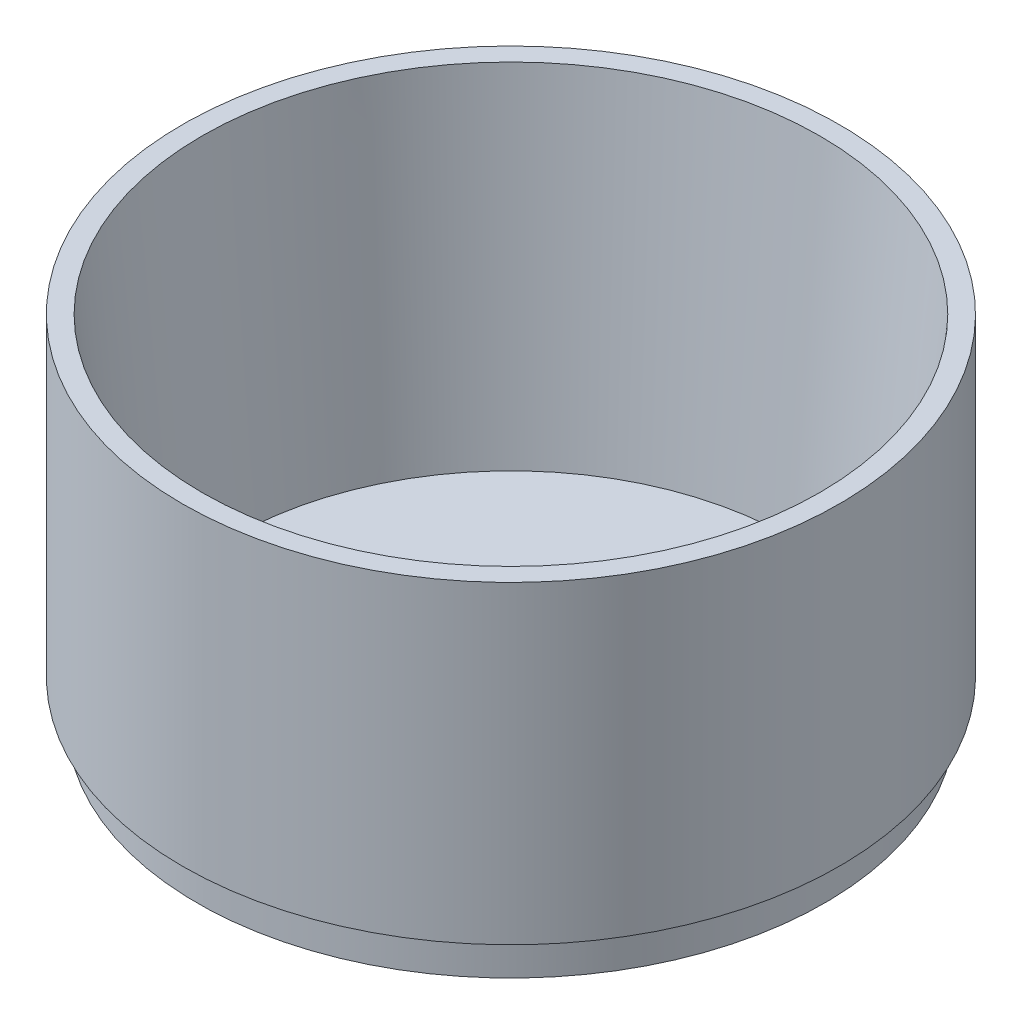
ISO-10303-21;
HEADER;
FILE_DESCRIPTION(('STEP AP214'),'2;1');
FILE_NAME('part.step','',(''),(''),'','','');
FILE_SCHEMA(('AUTOMOTIVE_DESIGN { 1 0 10303 214 1 1 1 1 }'));
ENDSEC;
DATA;
#1=APPLICATION_CONTEXT('core data for automotive mechanical design processes');
#2=APPLICATION_PROTOCOL_DEFINITION('international standard','automotive_design',2000,#1);
#3=PRODUCT_CONTEXT('',#1,'mechanical');
#4=PRODUCT('Part','Part','',(#3));
#5=PRODUCT_RELATED_PRODUCT_CATEGORY('part','',(#4));
#6=PRODUCT_DEFINITION_FORMATION('','',#4);
#7=PRODUCT_DEFINITION_CONTEXT('part definition',#1,'design');
#8=PRODUCT_DEFINITION('design','',#6,#7);
#9=PRODUCT_DEFINITION_SHAPE('','',#8);
#10=(LENGTH_UNIT() NAMED_UNIT(*) SI_UNIT(.MILLI.,.METRE.));
#11=(NAMED_UNIT(*) PLANE_ANGLE_UNIT() SI_UNIT($,.RADIAN.));
#12=(NAMED_UNIT(*) SI_UNIT($,.STERADIAN.) SOLID_ANGLE_UNIT());
#13=UNCERTAINTY_MEASURE_WITH_UNIT(LENGTH_MEASURE(1.E-05),#10,'distance_accuracy_value','');
#14=(GEOMETRIC_REPRESENTATION_CONTEXT(3) GLOBAL_UNCERTAINTY_ASSIGNED_CONTEXT((#13)) GLOBAL_UNIT_ASSIGNED_CONTEXT((#10,
#11,#12)) REPRESENTATION_CONTEXT('',''));
#15=CARTESIAN_POINT('',(0.,0.,0.));
#16=DIRECTION('',(0.,0.,1.));
#17=DIRECTION('',(1.,0.,0.));
#18=AXIS2_PLACEMENT_3D('',#15,#16,#17);
#19=CARTESIAN_POINT('',(0.,50.8,0.));
#20=DIRECTION('',(0.,-1.,0.));
#21=DIRECTION('',(0.,0.,-1.));
#22=AXIS2_PLACEMENT_3D('',#19,#20,#21);
#23=CYLINDRICAL_SURFACE('',#22,53.18125);
#24=CARTESIAN_POINT('',(0.,50.8,0.));
#25=DIRECTION('',(0.,1.,0.));
#26=DIRECTION('',(0.,0.,1.));
#27=AXIS2_PLACEMENT_3D('',#24,#25,#26);
#28=CIRCLE('',#27,53.18125);
#29=CARTESIAN_POINT('',(0.,50.8,53.18125));
#30=VERTEX_POINT('',#29);
#31=EDGE_CURVE('E51',#30,#30,#28,.T.);
#32=ORIENTED_EDGE('',*,*,#31,.F.);
#33=EDGE_LOOP('',(#32));
#34=FACE_BOUND('',#33,.T.);
#35=CARTESIAN_POINT('',(0.,0.,0.));
#36=DIRECTION('',(0.,1.,0.));
#37=DIRECTION('',(0.,0.,1.));
#38=AXIS2_PLACEMENT_3D('',#35,#36,#37);
#39=CIRCLE('',#38,53.18125);
#40=CARTESIAN_POINT('',(0.,0.,53.18125));
#41=VERTEX_POINT('',#40);
#42=EDGE_CURVE('E46',#41,#41,#39,.T.);
#43=ORIENTED_EDGE('',*,*,#42,.T.);
#44=EDGE_LOOP('',(#43));
#45=FACE_BOUND('',#44,.T.);
#46=ADVANCED_FACE('F43',(#34,#45),#23,.T.);
#47=CARTESIAN_POINT('',(0.,50.8,0.));
#48=DIRECTION('',(0.,1.,0.));
#49=DIRECTION('',(0.,0.,1.));
#50=AXIS2_PLACEMENT_3D('',#47,#48,#49);
#51=PLANE('',#50);
#52=CARTESIAN_POINT('',(0.,50.8,0.));
#53=DIRECTION('',(0.,1.,0.));
#54=DIRECTION('',(0.,0.,1.));
#55=AXIS2_PLACEMENT_3D('',#52,#53,#54);
#56=CIRCLE('',#55,50.00625);
#57=CARTESIAN_POINT('',(0.,50.8,50.00625));
#58=VERTEX_POINT('',#57);
#59=EDGE_CURVE('E66',#58,#58,#56,.T.);
#60=ORIENTED_EDGE('',*,*,#59,.F.);
#61=EDGE_LOOP('',(#60));
#62=FACE_BOUND('',#61,.T.);
#63=ORIENTED_EDGE('',*,*,#31,.T.);
#64=EDGE_LOOP('',(#63));
#65=FACE_BOUND('',#64,.T.);
#66=ADVANCED_FACE('F121',(#62,#65),#51,.T.);
#67=CARTESIAN_POINT('',(0.,0.,0.));
#68=DIRECTION('',(0.,1.,0.));
#69=DIRECTION('',(0.,0.,1.));
#70=AXIS2_PLACEMENT_3D('',#67,#68,#69);
#71=PLANE('',#70);
#72=CARTESIAN_POINT('',(0.,0.,0.));
#73=DIRECTION('',(0.,-1.,0.));
#74=DIRECTION('',(0.,0.,-1.));
#75=AXIS2_PLACEMENT_3D('',#72,#73,#74);
#76=CIRCLE('',#75,50.8);
#77=CARTESIAN_POINT('',(0.,0.,-50.8));
#78=VERTEX_POINT('',#77);
#79=EDGE_CURVE('E11',#78,#78,#76,.T.);
#80=ORIENTED_EDGE('',*,*,#79,.F.);
#81=EDGE_LOOP('',(#80));
#82=FACE_BOUND('',#81,.T.);
#83=ORIENTED_EDGE('',*,*,#42,.F.);
#84=EDGE_LOOP('',(#83));
#85=FACE_BOUND('',#84,.T.);
#86=ADVANCED_FACE('F126',(#82,#85),#71,.F.);
#87=CARTESIAN_POINT('',(0.,-6.35,0.));
#88=DIRECTION('',(0.,1.,0.));
#89=DIRECTION('',(0.,0.,1.));
#90=AXIS2_PLACEMENT_3D('',#87,#88,#89);
#91=CYLINDRICAL_SURFACE('',#90,50.8);
#92=CARTESIAN_POINT('',(0.,-6.35,0.));
#93=DIRECTION('',(0.,-1.,0.));
#94=DIRECTION('',(0.,0.,-1.));
#95=AXIS2_PLACEMENT_3D('',#92,#93,#94);
#96=CIRCLE('',#95,50.8);
#97=CARTESIAN_POINT('',(0.,-6.35,-50.8));
#98=VERTEX_POINT('',#97);
#99=EDGE_CURVE('E58',#98,#98,#96,.T.);
#100=ORIENTED_EDGE('',*,*,#99,.F.);
#101=EDGE_LOOP('',(#100));
#102=FACE_BOUND('',#101,.T.);
#103=ORIENTED_EDGE('',*,*,#79,.T.);
#104=EDGE_LOOP('',(#103));
#105=FACE_BOUND('',#104,.T.);
#106=ADVANCED_FACE('F136',(#102,#105),#91,.T.);
#107=CARTESIAN_POINT('',(0.,-6.35,0.));
#108=DIRECTION('',(0.,-1.,0.));
#109=DIRECTION('',(0.,0.,-1.));
#110=AXIS2_PLACEMENT_3D('',#107,#108,#109);
#111=PLANE('',#110);
#112=CARTESIAN_POINT('',(7.48713179512813,-6.35,15.7759869337034));
#113=DIRECTION('',(0.,-1.,0.));
#114=DIRECTION('',(0.,0.,-1.));
#115=AXIS2_PLACEMENT_3D('',#112,#113,#114);
#116=CIRCLE('',#115,4.7625);
#117=CARTESIAN_POINT('',(7.48713179512813,-6.35,11.0134869337034));
#118=VERTEX_POINT('',#117);
#119=EDGE_CURVE('E70',#118,#118,#116,.F.);
#120=ORIENTED_EDGE('',*,*,#119,.T.);
#121=EDGE_LOOP('',(#120));
#122=FACE_BOUND('',#121,.T.);
#123=CARTESIAN_POINT('',(1.2743573258838E-13,-6.35,0.));
#124=DIRECTION('',(0.,-1.,0.));
#125=DIRECTION('',(0.,0.,-1.));
#126=AXIS2_PLACEMENT_3D('',#123,#124,#125);
#127=CIRCLE('',#126,4.7625);
#128=CARTESIAN_POINT('',(1.2743573258838E-13,-6.35,-4.76250000000004));
#129=VERTEX_POINT('',#128);
#130=EDGE_CURVE('E80',#129,#129,#127,.F.);
#131=ORIENTED_EDGE('',*,*,#130,.T.);
#132=EDGE_LOOP('',(#131));
#133=FACE_BOUND('',#132,.T.);
#134=CARTESIAN_POINT('',(-7.48713179512813,-6.35,-15.7759869337034));
#135=DIRECTION('',(0.,-1.,0.));
#136=DIRECTION('',(0.,0.,-1.));
#137=AXIS2_PLACEMENT_3D('',#134,#135,#136);
#138=CIRCLE('',#137,4.7625);
#139=CARTESIAN_POINT('',(-7.48713179512813,-6.35,-20.5384869337034));
#140=VERTEX_POINT('',#139);
#141=EDGE_CURVE('E71',#140,#140,#138,.F.);
#142=ORIENTED_EDGE('',*,*,#141,.T.);
#143=EDGE_LOOP('',(#142));
#144=FACE_BOUND('',#143,.T.);
#145=ORIENTED_EDGE('',*,*,#99,.T.);
#146=EDGE_LOOP('',(#145));
#147=FACE_BOUND('',#146,.T.);
#148=ADVANCED_FACE('F102',(#122,#133,#144,#147),#111,.T.);
#149=CARTESIAN_POINT('',(0.,-3.175,0.));
#150=DIRECTION('',(0.,-1.,0.));
#151=DIRECTION('',(0.,0.,-1.));
#152=AXIS2_PLACEMENT_3D('',#149,#150,#151);
#153=PLANE('',#152);
#154=CARTESIAN_POINT('',(7.48713179512813,-3.175,15.7759869337034));
#155=DIRECTION('',(0.,1.,0.));
#156=DIRECTION('',(0.,0.,1.));
#157=AXIS2_PLACEMENT_3D('',#154,#155,#156);
#158=CIRCLE('',#157,4.7625);
#159=CARTESIAN_POINT('',(7.48713179512813,-3.175,20.5384869337034));
#160=VERTEX_POINT('',#159);
#161=EDGE_CURVE('E84',#160,#160,#158,.T.);
#162=ORIENTED_EDGE('',*,*,#161,.F.);
#163=EDGE_LOOP('',(#162));
#164=FACE_BOUND('',#163,.T.);
#165=CARTESIAN_POINT('',(1.2743573258838E-13,-3.175,0.));
#166=DIRECTION('',(0.,1.,0.));
#167=DIRECTION('',(0.,0.,1.));
#168=AXIS2_PLACEMENT_3D('',#165,#166,#167);
#169=CIRCLE('',#168,4.7625);
#170=CARTESIAN_POINT('',(1.2743573258838E-13,-3.175,4.76249999999996));
#171=VERTEX_POINT('',#170);
#172=EDGE_CURVE('E75',#171,#171,#169,.T.);
#173=ORIENTED_EDGE('',*,*,#172,.F.);
#174=EDGE_LOOP('',(#173));
#175=FACE_BOUND('',#174,.T.);
#176=CARTESIAN_POINT('',(-7.48713179512813,-3.175,-15.7759869337034));
#177=DIRECTION('',(0.,1.,0.));
#178=DIRECTION('',(0.,0.,1.));
#179=AXIS2_PLACEMENT_3D('',#176,#177,#178);
#180=CIRCLE('',#179,4.7625);
#181=CARTESIAN_POINT('',(-7.48713179512813,-3.175,-11.0134869337034));
#182=VERTEX_POINT('',#181);
#183=EDGE_CURVE('E76',#182,#182,#180,.T.);
#184=ORIENTED_EDGE('',*,*,#183,.F.);
#185=EDGE_LOOP('',(#184));
#186=FACE_BOUND('',#185,.T.);
#187=CARTESIAN_POINT('',(0.,-3.175,0.));
#188=DIRECTION('',(0.,-1.,0.));
#189=DIRECTION('',(0.,0.,-1.));
#190=AXIS2_PLACEMENT_3D('',#187,#188,#189);
#191=CIRCLE('',#190,45.2840493861882);
#192=CARTESIAN_POINT('',(0.,-3.175,-45.2840493861882));
#193=VERTEX_POINT('',#192);
#194=EDGE_CURVE('E62',#193,#193,#191,.F.);
#195=ORIENTED_EDGE('',*,*,#194,.T.);
#196=EDGE_LOOP('',(#195));
#197=FACE_BOUND('',#196,.T.);
#198=ADVANCED_FACE('F98',(#164,#175,#186,#197),#153,.F.);
#199=CARTESIAN_POINT('',(0.,50.8,0.));
#200=DIRECTION('',(0.,1.,0.));
#201=DIRECTION('',(0.,0.,1.));
#202=AXIS2_PLACEMENT_3D('',#199,#200,#201);
#203=CONICAL_SURFACE('',#202,50.00625,0.0872664625997165);
#204=ORIENTED_EDGE('',*,*,#59,.T.);
#205=EDGE_LOOP('',(#204));
#206=FACE_BOUND('',#205,.T.);
#207=ORIENTED_EDGE('',*,*,#194,.F.);
#208=EDGE_LOOP('',(#207));
#209=FACE_BOUND('',#208,.T.);
#210=ADVANCED_FACE('F101',(#206,#209),#203,.F.);
#211=CARTESIAN_POINT('',(-7.48713179512813,-19.8203841816037,-15.7759869337034));
#212=DIRECTION('',(0.,1.,0.));
#213=DIRECTION('',(0.,0.,1.));
#214=AXIS2_PLACEMENT_3D('',#211,#212,#213);
#215=CYLINDRICAL_SURFACE('',#214,4.7625);
#216=ORIENTED_EDGE('',*,*,#183,.T.);
#217=EDGE_LOOP('',(#216));
#218=FACE_BOUND('',#217,.T.);
#219=ORIENTED_EDGE('',*,*,#141,.F.);
#220=EDGE_LOOP('',(#219));
#221=FACE_BOUND('',#220,.T.);
#222=ADVANCED_FACE('F111',(#218,#221),#215,.F.);
#223=CARTESIAN_POINT('',(1.2743573258838E-13,-19.8203841816037,0.));
#224=DIRECTION('',(0.,1.,0.));
#225=DIRECTION('',(0.,0.,1.));
#226=AXIS2_PLACEMENT_3D('',#223,#224,#225);
#227=CYLINDRICAL_SURFACE('',#226,4.7625);
#228=ORIENTED_EDGE('',*,*,#172,.T.);
#229=EDGE_LOOP('',(#228));
#230=FACE_BOUND('',#229,.T.);
#231=ORIENTED_EDGE('',*,*,#130,.F.);
#232=EDGE_LOOP('',(#231));
#233=FACE_BOUND('',#232,.T.);
#234=ADVANCED_FACE('F117',(#230,#233),#227,.F.);
#235=CARTESIAN_POINT('',(7.48713179512813,-19.8203841816037,15.7759869337034));
#236=DIRECTION('',(0.,1.,0.));
#237=DIRECTION('',(0.,0.,1.));
#238=AXIS2_PLACEMENT_3D('',#235,#236,#237);
#239=CYLINDRICAL_SURFACE('',#238,4.7625);
#240=ORIENTED_EDGE('',*,*,#161,.T.);
#241=EDGE_LOOP('',(#240));
#242=FACE_BOUND('',#241,.T.);
#243=ORIENTED_EDGE('',*,*,#119,.F.);
#244=EDGE_LOOP('',(#243));
#245=FACE_BOUND('',#244,.T.);
#246=ADVANCED_FACE('F95',(#242,#245),#239,.F.);
#247=CLOSED_SHELL('',(#46,#66,#86,#106,#148,#198,#210,#222,#234,#246));
#248=MANIFOLD_SOLID_BREP('B2',#247);
#249=ADVANCED_BREP_SHAPE_REPRESENTATION('',(#18,#248),#14);
#250=SHAPE_DEFINITION_REPRESENTATION(#9,#249);
ENDSEC;
END-ISO-10303-21;
